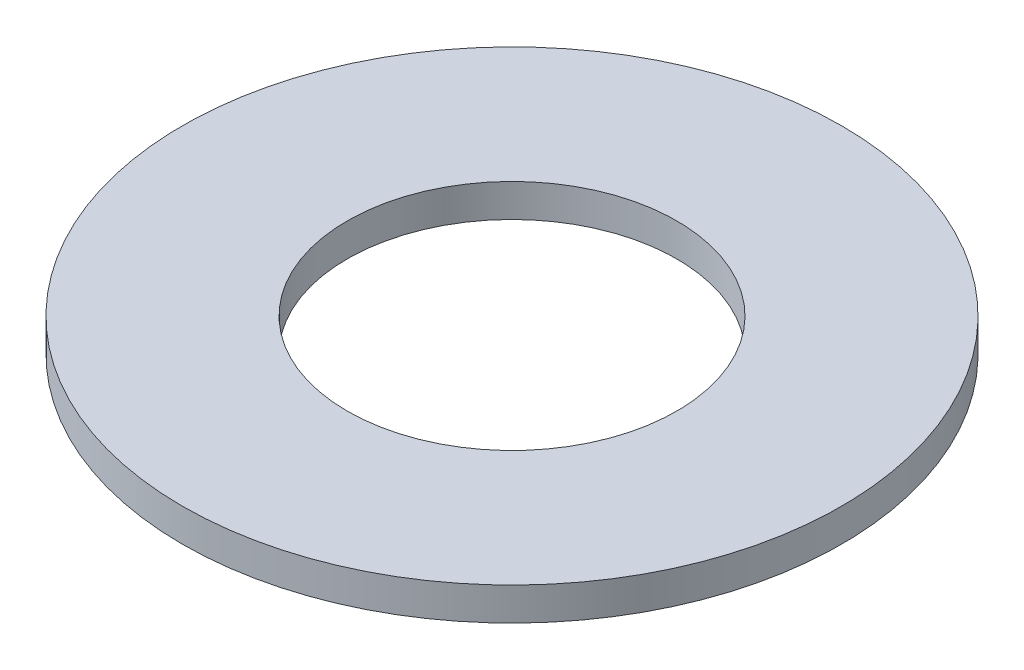
ISO-10303-21;
HEADER;
FILE_DESCRIPTION(('STEP AP214'),'2;1');
FILE_NAME('part.step','',(''),(''),'','','');
FILE_SCHEMA(('AUTOMOTIVE_DESIGN { 1 0 10303 214 1 1 1 1 }'));
ENDSEC;
DATA;
#1=APPLICATION_CONTEXT('core data for automotive mechanical design processes');
#2=APPLICATION_PROTOCOL_DEFINITION('international standard','automotive_design',2000,#1);
#3=PRODUCT_CONTEXT('',#1,'mechanical');
#4=PRODUCT('Part','Part','',(#3));
#5=PRODUCT_RELATED_PRODUCT_CATEGORY('part','',(#4));
#6=PRODUCT_DEFINITION_FORMATION('','',#4);
#7=PRODUCT_DEFINITION_CONTEXT('part definition',#1,'design');
#8=PRODUCT_DEFINITION('design','',#6,#7);
#9=PRODUCT_DEFINITION_SHAPE('','',#8);
#10=(LENGTH_UNIT() NAMED_UNIT(*) SI_UNIT(.MILLI.,.METRE.));
#11=(NAMED_UNIT(*) PLANE_ANGLE_UNIT() SI_UNIT($,.RADIAN.));
#12=(NAMED_UNIT(*) SI_UNIT($,.STERADIAN.) SOLID_ANGLE_UNIT());
#13=UNCERTAINTY_MEASURE_WITH_UNIT(LENGTH_MEASURE(1.E-05),#10,'distance_accuracy_value','');
#14=(GEOMETRIC_REPRESENTATION_CONTEXT(3) GLOBAL_UNCERTAINTY_ASSIGNED_CONTEXT((#13)) GLOBAL_UNIT_ASSIGNED_CONTEXT((#10,
#11,#12)) REPRESENTATION_CONTEXT('',''));
#15=CARTESIAN_POINT('',(0.,0.,0.));
#16=DIRECTION('',(0.,0.,1.));
#17=DIRECTION('',(1.,0.,0.));
#18=AXIS2_PLACEMENT_3D('',#15,#16,#17);
#19=CARTESIAN_POINT('',(0.,-1.,0.));
#20=DIRECTION('',(0.,1.,0.));
#21=DIRECTION('',(0.,0.,1.));
#22=AXIS2_PLACEMENT_3D('',#19,#20,#21);
#23=CYLINDRICAL_SURFACE('',#22,5.);
#24=CARTESIAN_POINT('',(0.,-1.,0.));
#25=DIRECTION('',(0.,1.,0.));
#26=DIRECTION('',(0.,0.,1.));
#27=AXIS2_PLACEMENT_3D('',#24,#25,#26);
#28=CIRCLE('',#27,5.);
#29=CARTESIAN_POINT('',(0.,-1.,5.));
#30=VERTEX_POINT('',#29);
#31=EDGE_CURVE('E40',#30,#30,#28,.T.);
#32=ORIENTED_EDGE('',*,*,#31,.F.);
#33=EDGE_LOOP('',(#32));
#34=FACE_BOUND('',#33,.T.);
#35=CARTESIAN_POINT('',(0.,0.,0.));
#36=DIRECTION('',(0.,1.,0.));
#37=DIRECTION('',(0.,0.,1.));
#38=AXIS2_PLACEMENT_3D('',#35,#36,#37);
#39=CIRCLE('',#38,5.);
#40=CARTESIAN_POINT('',(0.,0.,5.));
#41=VERTEX_POINT('',#40);
#42=EDGE_CURVE('E46',#41,#41,#39,.T.);
#43=ORIENTED_EDGE('',*,*,#42,.T.);
#44=EDGE_LOOP('',(#43));
#45=FACE_BOUND('',#44,.T.);
#46=ADVANCED_FACE('F33',(#34,#45),#23,.F.);
#47=CARTESIAN_POINT('',(0.,-1.,0.));
#48=DIRECTION('',(0.,1.,0.));
#49=DIRECTION('',(0.,0.,1.));
#50=AXIS2_PLACEMENT_3D('',#47,#48,#49);
#51=CYLINDRICAL_SURFACE('',#50,10.);
#52=CARTESIAN_POINT('',(0.,-1.,0.));
#53=DIRECTION('',(0.,1.,0.));
#54=DIRECTION('',(0.,0.,1.));
#55=AXIS2_PLACEMENT_3D('',#52,#53,#54);
#56=CIRCLE('',#55,10.);
#57=CARTESIAN_POINT('',(0.,-1.,10.));
#58=VERTEX_POINT('',#57);
#59=EDGE_CURVE('E10',#58,#58,#56,.T.);
#60=ORIENTED_EDGE('',*,*,#59,.T.);
#61=EDGE_LOOP('',(#60));
#62=FACE_BOUND('',#61,.T.);
#63=CARTESIAN_POINT('',(0.,0.,0.));
#64=DIRECTION('',(0.,1.,0.));
#65=DIRECTION('',(0.,0.,1.));
#66=AXIS2_PLACEMENT_3D('',#63,#64,#65);
#67=CIRCLE('',#66,10.);
#68=CARTESIAN_POINT('',(0.,0.,10.));
#69=VERTEX_POINT('',#68);
#70=EDGE_CURVE('E36',#69,#69,#67,.T.);
#71=ORIENTED_EDGE('',*,*,#70,.F.);
#72=EDGE_LOOP('',(#71));
#73=FACE_BOUND('',#72,.T.);
#74=ADVANCED_FACE('F55',(#62,#73),#51,.T.);
#75=CARTESIAN_POINT('',(0.,-1.,0.));
#76=DIRECTION('',(0.,1.,0.));
#77=DIRECTION('',(0.,0.,1.));
#78=AXIS2_PLACEMENT_3D('',#75,#76,#77);
#79=PLANE('',#78);
#80=ORIENTED_EDGE('',*,*,#31,.T.);
#81=EDGE_LOOP('',(#80));
#82=FACE_BOUND('',#81,.T.);
#83=ORIENTED_EDGE('',*,*,#59,.F.);
#84=EDGE_LOOP('',(#83));
#85=FACE_BOUND('',#84,.T.);
#86=ADVANCED_FACE('F57',(#82,#85),#79,.F.);
#87=CARTESIAN_POINT('',(0.,0.,0.));
#88=DIRECTION('',(0.,1.,0.));
#89=DIRECTION('',(0.,0.,1.));
#90=AXIS2_PLACEMENT_3D('',#87,#88,#89);
#91=PLANE('',#90);
#92=ORIENTED_EDGE('',*,*,#42,.F.);
#93=EDGE_LOOP('',(#92));
#94=FACE_BOUND('',#93,.T.);
#95=ORIENTED_EDGE('',*,*,#70,.T.);
#96=EDGE_LOOP('',(#95));
#97=FACE_BOUND('',#96,.T.);
#98=ADVANCED_FACE('F53',(#94,#97),#91,.T.);
#99=CLOSED_SHELL('',(#46,#74,#86,#98));
#100=MANIFOLD_SOLID_BREP('B2',#99);
#101=ADVANCED_BREP_SHAPE_REPRESENTATION('',(#18,#100),#14);
#102=SHAPE_DEFINITION_REPRESENTATION(#9,#101);
ENDSEC;
END-ISO-10303-21;
